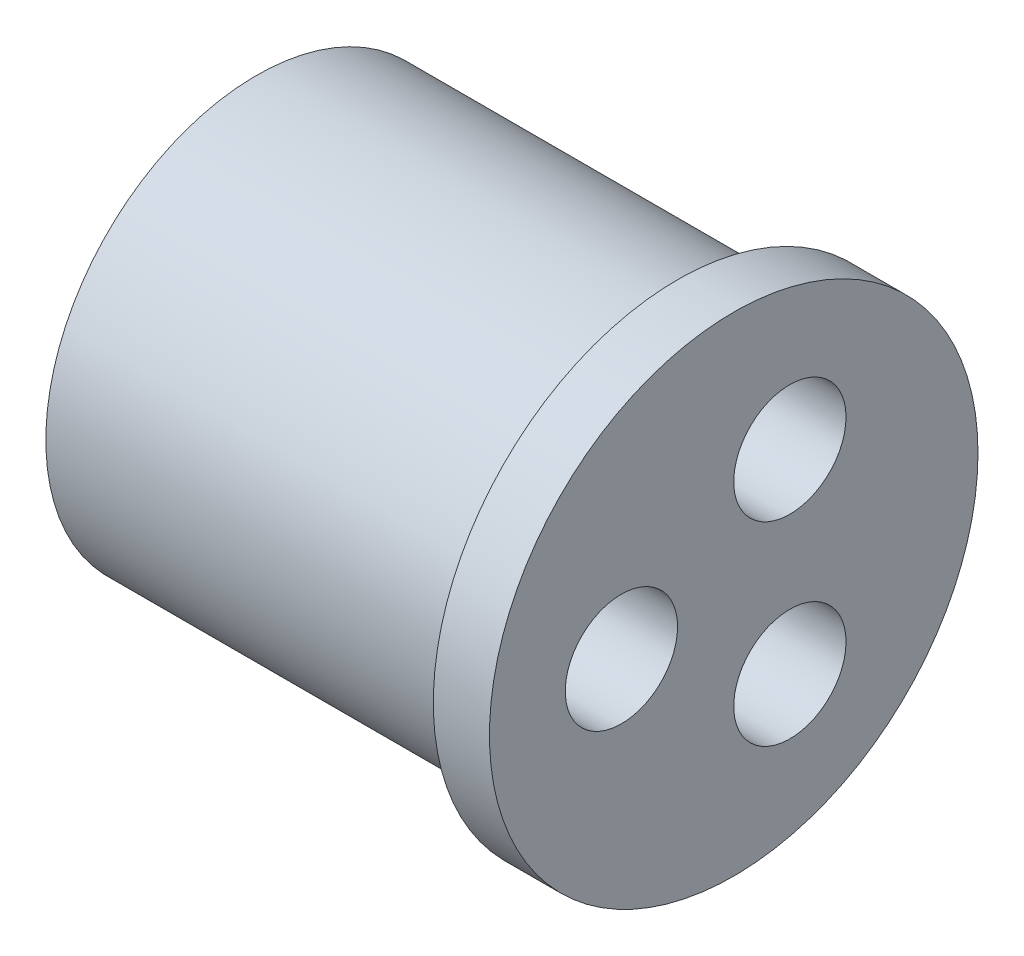
ISO-10303-21;
HEADER;
FILE_DESCRIPTION(('STEP AP214'),'2;1');
FILE_NAME('part.step','',(''),(''),'','','');
FILE_SCHEMA(('AUTOMOTIVE_DESIGN { 1 0 10303 214 1 1 1 1 }'));
ENDSEC;
DATA;
#1=APPLICATION_CONTEXT('core data for automotive mechanical design processes');
#2=APPLICATION_PROTOCOL_DEFINITION('international standard','automotive_design',2000,#1);
#3=PRODUCT_CONTEXT('',#1,'mechanical');
#4=PRODUCT('Part','Part','',(#3));
#5=PRODUCT_RELATED_PRODUCT_CATEGORY('part','',(#4));
#6=PRODUCT_DEFINITION_FORMATION('','',#4);
#7=PRODUCT_DEFINITION_CONTEXT('part definition',#1,'design');
#8=PRODUCT_DEFINITION('design','',#6,#7);
#9=PRODUCT_DEFINITION_SHAPE('','',#8);
#10=(LENGTH_UNIT() NAMED_UNIT(*) SI_UNIT(.MILLI.,.METRE.));
#11=(NAMED_UNIT(*) PLANE_ANGLE_UNIT() SI_UNIT($,.RADIAN.));
#12=(NAMED_UNIT(*) SI_UNIT($,.STERADIAN.) SOLID_ANGLE_UNIT());
#13=UNCERTAINTY_MEASURE_WITH_UNIT(LENGTH_MEASURE(1.E-05),#10,'distance_accuracy_value','');
#14=(GEOMETRIC_REPRESENTATION_CONTEXT(3) GLOBAL_UNCERTAINTY_ASSIGNED_CONTEXT((#13)) GLOBAL_UNIT_ASSIGNED_CONTEXT((#10,
#11,#12)) REPRESENTATION_CONTEXT('',''));
#15=CARTESIAN_POINT('',(0.,0.,0.));
#16=DIRECTION('',(0.,0.,1.));
#17=DIRECTION('',(1.,0.,0.));
#18=AXIS2_PLACEMENT_3D('',#15,#16,#17);
#19=CARTESIAN_POINT('',(0.,0.,0.));
#20=DIRECTION('',(1.,0.,0.));
#21=DIRECTION('',(0.,0.,-1.));
#22=AXIS2_PLACEMENT_3D('',#19,#20,#21);
#23=PLANE('',#22);
#24=CARTESIAN_POINT('',(0.,0.,0.));
#25=DIRECTION('',(1.,0.,0.));
#26=DIRECTION('',(0.,0.,-1.));
#27=AXIS2_PLACEMENT_3D('',#24,#25,#26);
#28=CIRCLE('',#27,37.5);
#29=CARTESIAN_POINT('',(0.,0.,-37.5));
#30=VERTEX_POINT('',#29);
#31=EDGE_CURVE('E38',#30,#30,#28,.T.);
#32=ORIENTED_EDGE('',*,*,#31,.F.);
#33=EDGE_LOOP('',(#32));
#34=FACE_BOUND('',#33,.T.);
#35=CARTESIAN_POINT('',(0.,0.,20.));
#36=DIRECTION('',(1.,0.,0.));
#37=DIRECTION('',(0.,0.,-1.));
#38=AXIS2_PLACEMENT_3D('',#35,#36,#37);
#39=CIRCLE('',#38,10.);
#40=CARTESIAN_POINT('',(0.,0.,10.));
#41=VERTEX_POINT('',#40);
#42=EDGE_CURVE('E45',#41,#41,#39,.T.);
#43=ORIENTED_EDGE('',*,*,#42,.T.);
#44=EDGE_LOOP('',(#43));
#45=FACE_BOUND('',#44,.T.);
#46=CARTESIAN_POINT('',(0.,17.3205080756886,-10.0000000000003));
#47=DIRECTION('',(1.,0.,0.));
#48=DIRECTION('',(0.,0.,-1.));
#49=AXIS2_PLACEMENT_3D('',#46,#47,#48);
#50=CIRCLE('',#49,10.);
#51=CARTESIAN_POINT('',(0.,17.3205080756886,-20.0000000000003));
#52=VERTEX_POINT('',#51);
#53=EDGE_CURVE('E49',#52,#52,#50,.T.);
#54=ORIENTED_EDGE('',*,*,#53,.T.);
#55=EDGE_LOOP('',(#54));
#56=FACE_BOUND('',#55,.T.);
#57=CARTESIAN_POINT('',(0.,-17.3205080756889,-9.99999999999983));
#58=DIRECTION('',(1.,0.,0.));
#59=DIRECTION('',(0.,0.,-1.));
#60=AXIS2_PLACEMENT_3D('',#57,#58,#59);
#61=CIRCLE('',#60,10.);
#62=CARTESIAN_POINT('',(0.,-17.3205080756889,-19.9999999999998));
#63=VERTEX_POINT('',#62);
#64=EDGE_CURVE('E52',#63,#63,#61,.T.);
#65=ORIENTED_EDGE('',*,*,#64,.T.);
#66=EDGE_LOOP('',(#65));
#67=FACE_BOUND('',#66,.T.);
#68=ADVANCED_FACE('F34',(#34,#45,#56,#67),#23,.F.);
#69=CARTESIAN_POINT('',(75.,0.,0.));
#70=DIRECTION('',(-1.,0.,0.));
#71=DIRECTION('',(0.,0.,1.));
#72=AXIS2_PLACEMENT_3D('',#69,#70,#71);
#73=CYLINDRICAL_SURFACE('',#72,37.5);
#74=CARTESIAN_POINT('',(75.,0.,0.));
#75=DIRECTION('',(1.,0.,0.));
#76=DIRECTION('',(0.,0.,-1.));
#77=AXIS2_PLACEMENT_3D('',#74,#75,#76);
#78=CIRCLE('',#77,37.5);
#79=CARTESIAN_POINT('',(75.,0.,-37.5));
#80=VERTEX_POINT('',#79);
#81=EDGE_CURVE('E10',#80,#80,#78,.T.);
#82=ORIENTED_EDGE('',*,*,#81,.F.);
#83=EDGE_LOOP('',(#82));
#84=FACE_BOUND('',#83,.T.);
#85=ORIENTED_EDGE('',*,*,#31,.T.);
#86=EDGE_LOOP('',(#85));
#87=FACE_BOUND('',#86,.T.);
#88=ADVANCED_FACE('F36',(#84,#87),#73,.T.);
#89=CARTESIAN_POINT('',(75.,0.,20.));
#90=DIRECTION('',(-1.,0.,0.));
#91=DIRECTION('',(0.,0.,1.));
#92=AXIS2_PLACEMENT_3D('',#89,#90,#91);
#93=CYLINDRICAL_SURFACE('',#92,10.);
#94=ORIENTED_EDGE('',*,*,#42,.F.);
#95=EDGE_LOOP('',(#94));
#96=FACE_BOUND('',#95,.T.);
#97=CARTESIAN_POINT('',(85.,0.,20.));
#98=DIRECTION('',(1.,0.,0.));
#99=DIRECTION('',(0.,0.,-1.));
#100=AXIS2_PLACEMENT_3D('',#97,#98,#99);
#101=CIRCLE('',#100,10.);
#102=CARTESIAN_POINT('',(85.,0.,10.));
#103=VERTEX_POINT('',#102);
#104=EDGE_CURVE('E59',#103,#103,#101,.T.);
#105=ORIENTED_EDGE('',*,*,#104,.T.);
#106=EDGE_LOOP('',(#105));
#107=FACE_BOUND('',#106,.T.);
#108=ADVANCED_FACE('F94',(#96,#107),#93,.F.);
#109=CARTESIAN_POINT('',(75.,17.3205080756886,-10.0000000000003));
#110=DIRECTION('',(-1.,0.,0.));
#111=DIRECTION('',(0.,0.,1.));
#112=AXIS2_PLACEMENT_3D('',#109,#110,#111);
#113=CYLINDRICAL_SURFACE('',#112,10.);
#114=ORIENTED_EDGE('',*,*,#53,.F.);
#115=EDGE_LOOP('',(#114));
#116=FACE_BOUND('',#115,.T.);
#117=CARTESIAN_POINT('',(85.,17.3205080756887,-10.0000000000001));
#118=DIRECTION('',(1.,0.,0.));
#119=DIRECTION('',(0.,0.,-1.));
#120=AXIS2_PLACEMENT_3D('',#117,#118,#119);
#121=CIRCLE('',#120,10.);
#122=CARTESIAN_POINT('',(85.,17.3205080756887,-20.0000000000001));
#123=VERTEX_POINT('',#122);
#124=EDGE_CURVE('E64',#123,#123,#121,.T.);
#125=ORIENTED_EDGE('',*,*,#124,.T.);
#126=EDGE_LOOP('',(#125));
#127=FACE_BOUND('',#126,.T.);
#128=ADVANCED_FACE('F84',(#116,#127),#113,.F.);
#129=CARTESIAN_POINT('',(75.,-17.3205080756889,-9.99999999999983));
#130=DIRECTION('',(-1.,0.,0.));
#131=DIRECTION('',(0.,0.,1.));
#132=AXIS2_PLACEMENT_3D('',#129,#130,#131);
#133=CYLINDRICAL_SURFACE('',#132,10.);
#134=ORIENTED_EDGE('',*,*,#64,.F.);
#135=EDGE_LOOP('',(#134));
#136=FACE_BOUND('',#135,.T.);
#137=CARTESIAN_POINT('',(85.,-17.3205080756889,-9.99999999999984));
#138=DIRECTION('',(1.,0.,0.));
#139=DIRECTION('',(0.,0.,-1.));
#140=AXIS2_PLACEMENT_3D('',#137,#138,#139);
#141=CIRCLE('',#140,10.);
#142=CARTESIAN_POINT('',(85.,-17.3205080756889,-19.9999999999998));
#143=VERTEX_POINT('',#142);
#144=EDGE_CURVE('E67',#143,#143,#141,.T.);
#145=ORIENTED_EDGE('',*,*,#144,.T.);
#146=EDGE_LOOP('',(#145));
#147=FACE_BOUND('',#146,.T.);
#148=ADVANCED_FACE('F71',(#136,#147),#133,.F.);
#149=CARTESIAN_POINT('',(85.,0.,0.));
#150=DIRECTION('',(1.,0.,0.));
#151=DIRECTION('',(0.,0.,-1.));
#152=AXIS2_PLACEMENT_3D('',#149,#150,#151);
#153=PLANE('',#152);
#154=ORIENTED_EDGE('',*,*,#124,.F.);
#155=EDGE_LOOP('',(#154));
#156=FACE_BOUND('',#155,.T.);
#157=CARTESIAN_POINT('',(85.,0.,0.));
#158=DIRECTION('',(1.,0.,0.));
#159=DIRECTION('',(0.,0.,-1.));
#160=AXIS2_PLACEMENT_3D('',#157,#158,#159);
#161=CIRCLE('',#160,43.5);
#162=CARTESIAN_POINT('',(85.,0.,-43.5));
#163=VERTEX_POINT('',#162);
#164=EDGE_CURVE('E55',#163,#163,#161,.T.);
#165=ORIENTED_EDGE('',*,*,#164,.T.);
#166=EDGE_LOOP('',(#165));
#167=FACE_BOUND('',#166,.T.);
#168=ORIENTED_EDGE('',*,*,#104,.F.);
#169=EDGE_LOOP('',(#168));
#170=FACE_BOUND('',#169,.T.);
#171=ORIENTED_EDGE('',*,*,#144,.F.);
#172=EDGE_LOOP('',(#171));
#173=FACE_BOUND('',#172,.T.);
#174=ADVANCED_FACE('F73',(#156,#167,#170,#173),#153,.T.);
#175=CARTESIAN_POINT('',(75.,0.,0.));
#176=DIRECTION('',(1.,0.,0.));
#177=DIRECTION('',(0.,0.,-1.));
#178=AXIS2_PLACEMENT_3D('',#175,#176,#177);
#179=PLANE('',#178);
#180=ORIENTED_EDGE('',*,*,#81,.T.);
#181=EDGE_LOOP('',(#180));
#182=FACE_BOUND('',#181,.T.);
#183=CARTESIAN_POINT('',(75.,0.,0.));
#184=DIRECTION('',(1.,0.,0.));
#185=DIRECTION('',(0.,0.,-1.));
#186=AXIS2_PLACEMENT_3D('',#183,#184,#185);
#187=CIRCLE('',#186,43.5);
#188=CARTESIAN_POINT('',(75.,0.,-43.5));
#189=VERTEX_POINT('',#188);
#190=EDGE_CURVE('E56',#189,#189,#187,.T.);
#191=ORIENTED_EDGE('',*,*,#190,.F.);
#192=EDGE_LOOP('',(#191));
#193=FACE_BOUND('',#192,.T.);
#194=ADVANCED_FACE('F75',(#182,#193),#179,.F.);
#195=CARTESIAN_POINT('',(85.,0.,0.));
#196=DIRECTION('',(-1.,0.,0.));
#197=DIRECTION('',(0.,0.,1.));
#198=AXIS2_PLACEMENT_3D('',#195,#196,#197);
#199=CYLINDRICAL_SURFACE('',#198,43.5);
#200=ORIENTED_EDGE('',*,*,#164,.F.);
#201=EDGE_LOOP('',(#200));
#202=FACE_BOUND('',#201,.T.);
#203=ORIENTED_EDGE('',*,*,#190,.T.);
#204=EDGE_LOOP('',(#203));
#205=FACE_BOUND('',#204,.T.);
#206=ADVANCED_FACE('F82',(#202,#205),#199,.T.);
#207=CLOSED_SHELL('',(#68,#88,#108,#128,#148,#174,#194,#206));
#208=MANIFOLD_SOLID_BREP('B2',#207);
#209=ADVANCED_BREP_SHAPE_REPRESENTATION('',(#18,#208),#14);
#210=SHAPE_DEFINITION_REPRESENTATION(#9,#209);
ENDSEC;
END-ISO-10303-21;
